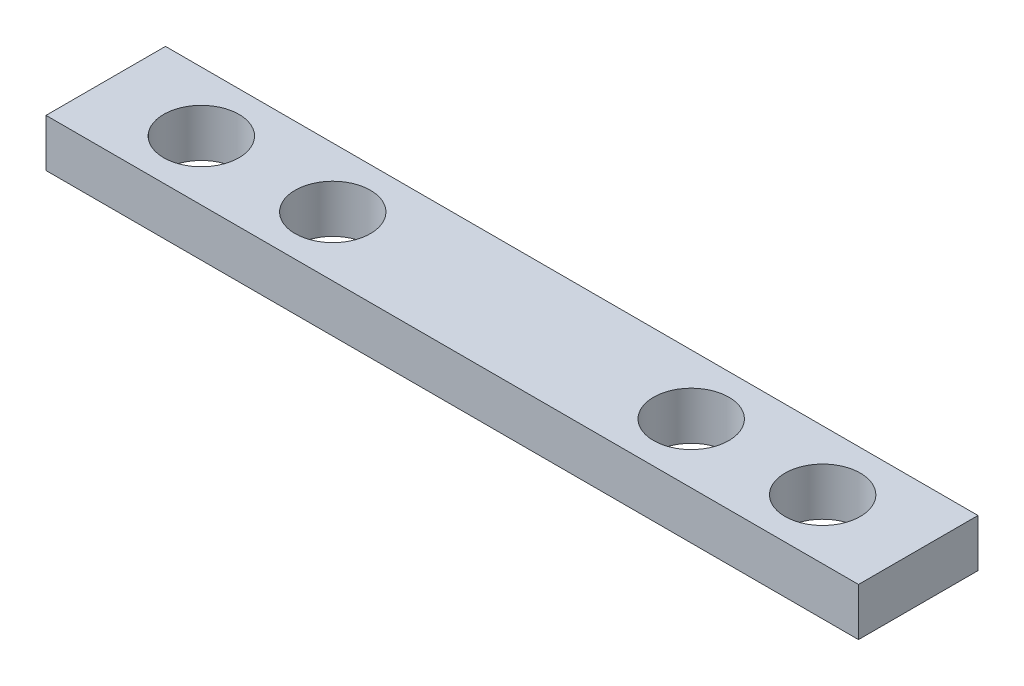
ISO-10303-21;
HEADER;
FILE_DESCRIPTION(('STEP AP214'),'2;1');
FILE_NAME('part.step','',(''),(''),'','','');
FILE_SCHEMA(('AUTOMOTIVE_DESIGN { 1 0 10303 214 1 1 1 1 }'));
ENDSEC;
DATA;
#1=APPLICATION_CONTEXT('core data for automotive mechanical design processes');
#2=APPLICATION_PROTOCOL_DEFINITION('international standard','automotive_design',2000,#1);
#3=PRODUCT_CONTEXT('',#1,'mechanical');
#4=PRODUCT('Part','Part','',(#3));
#5=PRODUCT_RELATED_PRODUCT_CATEGORY('part','',(#4));
#6=PRODUCT_DEFINITION_FORMATION('','',#4);
#7=PRODUCT_DEFINITION_CONTEXT('part definition',#1,'design');
#8=PRODUCT_DEFINITION('design','',#6,#7);
#9=PRODUCT_DEFINITION_SHAPE('','',#8);
#10=(LENGTH_UNIT() NAMED_UNIT(*) SI_UNIT(.MILLI.,.METRE.));
#11=(NAMED_UNIT(*) PLANE_ANGLE_UNIT() SI_UNIT($,.RADIAN.));
#12=(NAMED_UNIT(*) SI_UNIT($,.STERADIAN.) SOLID_ANGLE_UNIT());
#13=UNCERTAINTY_MEASURE_WITH_UNIT(LENGTH_MEASURE(1.E-05),#10,'distance_accuracy_value','');
#14=(GEOMETRIC_REPRESENTATION_CONTEXT(3) GLOBAL_UNCERTAINTY_ASSIGNED_CONTEXT((#13)) GLOBAL_UNIT_ASSIGNED_CONTEXT((#10,
#11,#12)) REPRESENTATION_CONTEXT('',''));
#15=CARTESIAN_POINT('',(0.,0.,0.));
#16=DIRECTION('',(0.,0.,1.));
#17=DIRECTION('',(1.,0.,0.));
#18=AXIS2_PLACEMENT_3D('',#15,#16,#17);
#19=CARTESIAN_POINT('',(17.,2.,2.5));
#20=DIRECTION('',(-1.,0.,0.));
#21=DIRECTION('',(0.,0.,1.));
#22=AXIS2_PLACEMENT_3D('',#19,#20,#21);
#23=PLANE('',#22);
#24=DIRECTION('',(0.,0.,-1.));
#25=VECTOR('',#24,1.);
#26=CARTESIAN_POINT('',(17.,0.,2.5));
#27=LINE('',#26,#25);
#28=CARTESIAN_POINT('',(17.,0.,2.5));
#29=VERTEX_POINT('',#28);
#30=CARTESIAN_POINT('',(17.,0.,-2.5));
#31=VERTEX_POINT('',#30);
#32=EDGE_CURVE('E107',#29,#31,#27,.T.);
#33=ORIENTED_EDGE('',*,*,#32,.T.);
#34=DIRECTION('',(0.,-1.,0.));
#35=VECTOR('',#34,1.);
#36=CARTESIAN_POINT('',(17.,2.,-2.5));
#37=LINE('',#36,#35);
#38=CARTESIAN_POINT('',(17.,2.,-2.5));
#39=VERTEX_POINT('',#38);
#40=EDGE_CURVE('E11',#39,#31,#37,.T.);
#41=ORIENTED_EDGE('',*,*,#40,.F.);
#42=DIRECTION('',(0.,0.,-1.));
#43=VECTOR('',#42,1.);
#44=CARTESIAN_POINT('',(17.,2.,2.5));
#45=LINE('',#44,#43);
#46=CARTESIAN_POINT('',(17.,2.,2.5));
#47=VERTEX_POINT('',#46);
#48=EDGE_CURVE('E91',#47,#39,#45,.T.);
#49=ORIENTED_EDGE('',*,*,#48,.F.);
#50=DIRECTION('',(0.,-1.,0.));
#51=VECTOR('',#50,1.);
#52=CARTESIAN_POINT('',(17.,2.,2.5));
#53=LINE('',#52,#51);
#54=EDGE_CURVE('E103',#47,#29,#53,.T.);
#55=ORIENTED_EDGE('',*,*,#54,.T.);
#56=EDGE_LOOP('',(#33,#41,#49,#55));
#57=FACE_BOUND('',#56,.T.);
#58=ADVANCED_FACE('F39',(#57),#23,.F.);
#59=CARTESIAN_POINT('',(-17.,2.,-2.5));
#60=DIRECTION('',(0.,0.,1.));
#61=DIRECTION('',(1.,0.,0.));
#62=AXIS2_PLACEMENT_3D('',#59,#60,#61);
#63=PLANE('',#62);
#64=DIRECTION('',(-1.,0.,0.));
#65=VECTOR('',#64,1.);
#66=CARTESIAN_POINT('',(-17.,0.,-2.5));
#67=LINE('',#66,#65);
#68=CARTESIAN_POINT('',(-17.,0.,-2.5));
#69=VERTEX_POINT('',#68);
#70=EDGE_CURVE('E96',#31,#69,#67,.T.);
#71=ORIENTED_EDGE('',*,*,#70,.T.);
#72=DIRECTION('',(0.,-1.,0.));
#73=VECTOR('',#72,1.);
#74=CARTESIAN_POINT('',(-17.,2.,-2.5));
#75=LINE('',#74,#73);
#76=CARTESIAN_POINT('',(-17.,2.,-2.5));
#77=VERTEX_POINT('',#76);
#78=EDGE_CURVE('E48',#77,#69,#75,.T.);
#79=ORIENTED_EDGE('',*,*,#78,.F.);
#80=DIRECTION('',(-1.,0.,0.));
#81=VECTOR('',#80,1.);
#82=CARTESIAN_POINT('',(-17.,2.,-2.5));
#83=LINE('',#82,#81);
#84=EDGE_CURVE('E86',#39,#77,#83,.T.);
#85=ORIENTED_EDGE('',*,*,#84,.F.);
#86=ORIENTED_EDGE('',*,*,#40,.T.);
#87=EDGE_LOOP('',(#71,#79,#85,#86));
#88=FACE_BOUND('',#87,.T.);
#89=ADVANCED_FACE('F95',(#88),#63,.F.);
#90=CARTESIAN_POINT('',(-17.,2.,2.5));
#91=DIRECTION('',(1.,0.,0.));
#92=DIRECTION('',(0.,0.,-1.));
#93=AXIS2_PLACEMENT_3D('',#90,#91,#92);
#94=PLANE('',#93);
#95=DIRECTION('',(0.,0.,1.));
#96=VECTOR('',#95,1.);
#97=CARTESIAN_POINT('',(-17.,0.,2.5));
#98=LINE('',#97,#96);
#99=CARTESIAN_POINT('',(-17.,0.,2.5));
#100=VERTEX_POINT('',#99);
#101=EDGE_CURVE('E73',#69,#100,#98,.T.);
#102=ORIENTED_EDGE('',*,*,#101,.T.);
#103=DIRECTION('',(0.,-1.,0.));
#104=VECTOR('',#103,1.);
#105=CARTESIAN_POINT('',(-17.,2.,2.5));
#106=LINE('',#105,#104);
#107=CARTESIAN_POINT('',(-17.,2.,2.5));
#108=VERTEX_POINT('',#107);
#109=EDGE_CURVE('E98',#108,#100,#106,.T.);
#110=ORIENTED_EDGE('',*,*,#109,.F.);
#111=DIRECTION('',(0.,0.,1.));
#112=VECTOR('',#111,1.);
#113=CARTESIAN_POINT('',(-17.,2.,2.5));
#114=LINE('',#113,#112);
#115=EDGE_CURVE('E89',#77,#108,#114,.T.);
#116=ORIENTED_EDGE('',*,*,#115,.F.);
#117=ORIENTED_EDGE('',*,*,#78,.T.);
#118=EDGE_LOOP('',(#102,#110,#116,#117));
#119=FACE_BOUND('',#118,.T.);
#120=ADVANCED_FACE('F99',(#119),#94,.F.);
#121=CARTESIAN_POINT('',(-17.,2.,2.5));
#122=DIRECTION('',(0.,0.,-1.));
#123=DIRECTION('',(-1.,0.,0.));
#124=AXIS2_PLACEMENT_3D('',#121,#122,#123);
#125=PLANE('',#124);
#126=DIRECTION('',(1.,0.,0.));
#127=VECTOR('',#126,1.);
#128=CARTESIAN_POINT('',(-17.,0.,2.5));
#129=LINE('',#128,#127);
#130=EDGE_CURVE('E79',#100,#29,#129,.T.);
#131=ORIENTED_EDGE('',*,*,#130,.T.);
#132=ORIENTED_EDGE('',*,*,#54,.F.);
#133=DIRECTION('',(1.,0.,0.));
#134=VECTOR('',#133,1.);
#135=CARTESIAN_POINT('',(-17.,2.,2.5));
#136=LINE('',#135,#134);
#137=EDGE_CURVE('E56',#108,#47,#136,.T.);
#138=ORIENTED_EDGE('',*,*,#137,.F.);
#139=ORIENTED_EDGE('',*,*,#109,.T.);
#140=EDGE_LOOP('',(#131,#132,#138,#139));
#141=FACE_BOUND('',#140,.T.);
#142=ADVANCED_FACE('F121',(#141),#125,.F.);
#143=CARTESIAN_POINT('',(0.,2.,0.));
#144=DIRECTION('',(0.,-1.,0.));
#145=DIRECTION('',(0.,0.,-1.));
#146=AXIS2_PLACEMENT_3D('',#143,#144,#145);
#147=PLANE('',#146);
#148=CARTESIAN_POINT('',(-7.5,2.,0.));
#149=DIRECTION('',(0.,1.,0.));
#150=DIRECTION('',(0.,0.,1.));
#151=AXIS2_PLACEMENT_3D('',#148,#149,#150);
#152=CIRCLE('',#151,1.575);
#153=CARTESIAN_POINT('',(-7.5,2.,1.575));
#154=VERTEX_POINT('',#153);
#155=EDGE_CURVE('E152',#154,#154,#152,.T.);
#156=ORIENTED_EDGE('',*,*,#155,.F.);
#157=EDGE_LOOP('',(#156));
#158=FACE_BOUND('',#157,.T.);
#159=CARTESIAN_POINT('',(7.5,2.,0.));
#160=DIRECTION('',(0.,1.,0.));
#161=DIRECTION('',(0.,0.,1.));
#162=AXIS2_PLACEMENT_3D('',#159,#160,#161);
#163=CIRCLE('',#162,1.575);
#164=CARTESIAN_POINT('',(7.5,2.,1.575));
#165=VERTEX_POINT('',#164);
#166=EDGE_CURVE('E144',#165,#165,#163,.T.);
#167=ORIENTED_EDGE('',*,*,#166,.F.);
#168=EDGE_LOOP('',(#167));
#169=FACE_BOUND('',#168,.T.);
#170=CARTESIAN_POINT('',(-13.,2.,0.));
#171=DIRECTION('',(0.,1.,0.));
#172=DIRECTION('',(0.,0.,1.));
#173=AXIS2_PLACEMENT_3D('',#170,#171,#172);
#174=CIRCLE('',#173,1.575);
#175=CARTESIAN_POINT('',(-13.,2.,1.575));
#176=VERTEX_POINT('',#175);
#177=EDGE_CURVE('E137',#176,#176,#174,.T.);
#178=ORIENTED_EDGE('',*,*,#177,.F.);
#179=EDGE_LOOP('',(#178));
#180=FACE_BOUND('',#179,.T.);
#181=CARTESIAN_POINT('',(13.,2.,0.));
#182=DIRECTION('',(0.,1.,0.));
#183=DIRECTION('',(0.,0.,1.));
#184=AXIS2_PLACEMENT_3D('',#181,#182,#183);
#185=CIRCLE('',#184,1.575);
#186=CARTESIAN_POINT('',(13.,2.,1.575));
#187=VERTEX_POINT('',#186);
#188=EDGE_CURVE('E128',#187,#187,#185,.T.);
#189=ORIENTED_EDGE('',*,*,#188,.F.);
#190=EDGE_LOOP('',(#189));
#191=FACE_BOUND('',#190,.T.);
#192=ORIENTED_EDGE('',*,*,#48,.T.);
#193=ORIENTED_EDGE('',*,*,#84,.T.);
#194=ORIENTED_EDGE('',*,*,#115,.T.);
#195=ORIENTED_EDGE('',*,*,#137,.T.);
#196=EDGE_LOOP('',(#192,#193,#194,#195));
#197=FACE_BOUND('',#196,.T.);
#198=ADVANCED_FACE('F87',(#158,#169,#180,#191,#197),#147,.F.);
#199=CARTESIAN_POINT('',(0.,0.,0.));
#200=DIRECTION('',(0.,-1.,0.));
#201=DIRECTION('',(0.,0.,-1.));
#202=AXIS2_PLACEMENT_3D('',#199,#200,#201);
#203=PLANE('',#202);
#204=CARTESIAN_POINT('',(-7.5,0.,0.));
#205=DIRECTION('',(0.,1.,0.));
#206=DIRECTION('',(0.,0.,1.));
#207=AXIS2_PLACEMENT_3D('',#204,#205,#206);
#208=CIRCLE('',#207,1.575);
#209=CARTESIAN_POINT('',(-7.5,0.,1.575));
#210=VERTEX_POINT('',#209);
#211=EDGE_CURVE('E133',#210,#210,#208,.T.);
#212=ORIENTED_EDGE('',*,*,#211,.T.);
#213=EDGE_LOOP('',(#212));
#214=FACE_BOUND('',#213,.T.);
#215=CARTESIAN_POINT('',(7.5,0.,0.));
#216=DIRECTION('',(0.,1.,0.));
#217=DIRECTION('',(0.,0.,1.));
#218=AXIS2_PLACEMENT_3D('',#215,#216,#217);
#219=CIRCLE('',#218,1.575);
#220=CARTESIAN_POINT('',(7.5,0.,1.575));
#221=VERTEX_POINT('',#220);
#222=EDGE_CURVE('E148',#221,#221,#219,.T.);
#223=ORIENTED_EDGE('',*,*,#222,.T.);
#224=EDGE_LOOP('',(#223));
#225=FACE_BOUND('',#224,.T.);
#226=CARTESIAN_POINT('',(-13.,0.,0.));
#227=DIRECTION('',(0.,1.,0.));
#228=DIRECTION('',(0.,0.,1.));
#229=AXIS2_PLACEMENT_3D('',#226,#227,#228);
#230=CIRCLE('',#229,1.575);
#231=CARTESIAN_POINT('',(-13.,0.,1.575));
#232=VERTEX_POINT('',#231);
#233=EDGE_CURVE('E111',#232,#232,#230,.T.);
#234=ORIENTED_EDGE('',*,*,#233,.T.);
#235=EDGE_LOOP('',(#234));
#236=FACE_BOUND('',#235,.T.);
#237=CARTESIAN_POINT('',(13.,0.,0.));
#238=DIRECTION('',(0.,1.,0.));
#239=DIRECTION('',(0.,0.,1.));
#240=AXIS2_PLACEMENT_3D('',#237,#238,#239);
#241=CIRCLE('',#240,1.575);
#242=CARTESIAN_POINT('',(13.,0.,1.575));
#243=VERTEX_POINT('',#242);
#244=EDGE_CURVE('E132',#243,#243,#241,.T.);
#245=ORIENTED_EDGE('',*,*,#244,.T.);
#246=EDGE_LOOP('',(#245));
#247=FACE_BOUND('',#246,.T.);
#248=ORIENTED_EDGE('',*,*,#32,.F.);
#249=ORIENTED_EDGE('',*,*,#130,.F.);
#250=ORIENTED_EDGE('',*,*,#101,.F.);
#251=ORIENTED_EDGE('',*,*,#70,.F.);
#252=EDGE_LOOP('',(#248,#249,#250,#251));
#253=FACE_BOUND('',#252,.T.);
#254=ADVANCED_FACE('F124',(#214,#225,#236,#247,#253),#203,.T.);
#255=CARTESIAN_POINT('',(13.,0.,0.));
#256=DIRECTION('',(0.,1.,0.));
#257=DIRECTION('',(0.,0.,1.));
#258=AXIS2_PLACEMENT_3D('',#255,#256,#257);
#259=CYLINDRICAL_SURFACE('',#258,1.575);
#260=ORIENTED_EDGE('',*,*,#244,.F.);
#261=EDGE_LOOP('',(#260));
#262=FACE_BOUND('',#261,.T.);
#263=ORIENTED_EDGE('',*,*,#188,.T.);
#264=EDGE_LOOP('',(#263));
#265=FACE_BOUND('',#264,.T.);
#266=ADVANCED_FACE('F178',(#262,#265),#259,.F.);
#267=CARTESIAN_POINT('',(-13.,0.,0.));
#268=DIRECTION('',(0.,1.,0.));
#269=DIRECTION('',(0.,0.,1.));
#270=AXIS2_PLACEMENT_3D('',#267,#268,#269);
#271=CYLINDRICAL_SURFACE('',#270,1.575);
#272=ORIENTED_EDGE('',*,*,#233,.F.);
#273=EDGE_LOOP('',(#272));
#274=FACE_BOUND('',#273,.T.);
#275=ORIENTED_EDGE('',*,*,#177,.T.);
#276=EDGE_LOOP('',(#275));
#277=FACE_BOUND('',#276,.T.);
#278=ADVANCED_FACE('F180',(#274,#277),#271,.F.);
#279=CARTESIAN_POINT('',(7.5,0.,0.));
#280=DIRECTION('',(0.,1.,0.));
#281=DIRECTION('',(0.,0.,1.));
#282=AXIS2_PLACEMENT_3D('',#279,#280,#281);
#283=CYLINDRICAL_SURFACE('',#282,1.575);
#284=ORIENTED_EDGE('',*,*,#222,.F.);
#285=EDGE_LOOP('',(#284));
#286=FACE_BOUND('',#285,.T.);
#287=ORIENTED_EDGE('',*,*,#166,.T.);
#288=EDGE_LOOP('',(#287));
#289=FACE_BOUND('',#288,.T.);
#290=ADVANCED_FACE('F165',(#286,#289),#283,.F.);
#291=CARTESIAN_POINT('',(-7.5,0.,0.));
#292=DIRECTION('',(0.,1.,0.));
#293=DIRECTION('',(0.,0.,1.));
#294=AXIS2_PLACEMENT_3D('',#291,#292,#293);
#295=CYLINDRICAL_SURFACE('',#294,1.575);
#296=ORIENTED_EDGE('',*,*,#211,.F.);
#297=EDGE_LOOP('',(#296));
#298=FACE_BOUND('',#297,.T.);
#299=ORIENTED_EDGE('',*,*,#155,.T.);
#300=EDGE_LOOP('',(#299));
#301=FACE_BOUND('',#300,.T.);
#302=ADVANCED_FACE('F162',(#298,#301),#295,.F.);
#303=CLOSED_SHELL('',(#58,#89,#120,#142,#198,#254,#266,#278,#290,#302));
#304=MANIFOLD_SOLID_BREP('B2',#303);
#305=ADVANCED_BREP_SHAPE_REPRESENTATION('',(#18,#304),#14);
#306=SHAPE_DEFINITION_REPRESENTATION(#9,#305);
ENDSEC;
END-ISO-10303-21;
